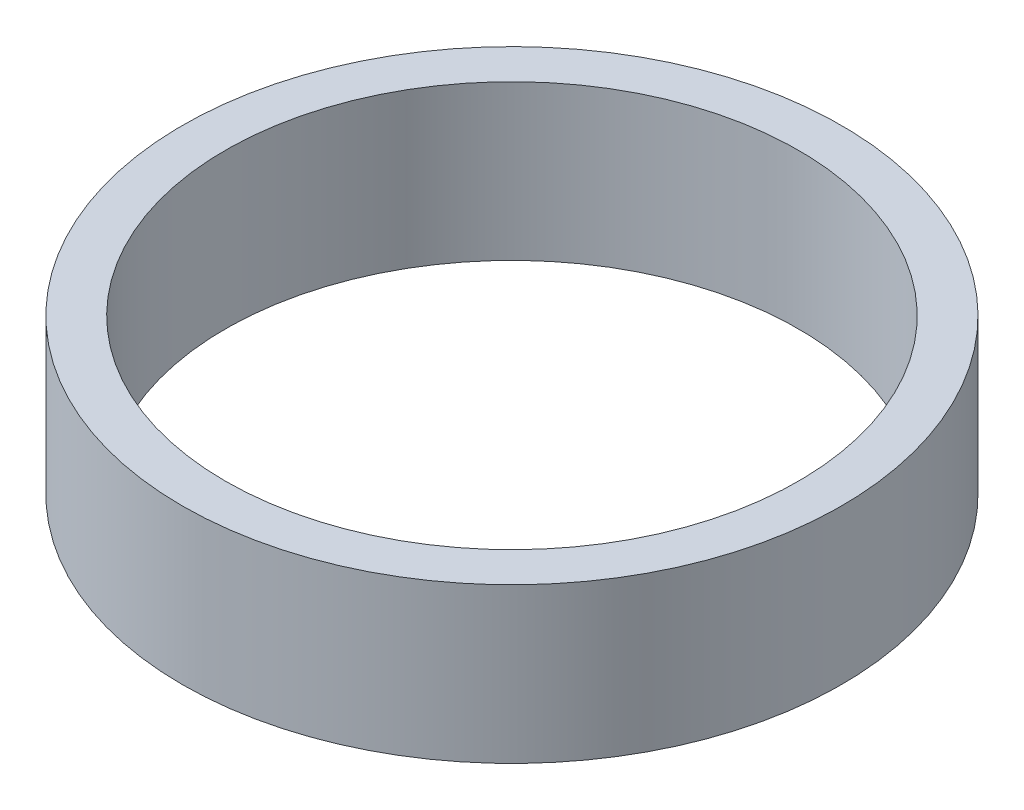
ISO-10303-21;
HEADER;
FILE_DESCRIPTION(('STEP AP214'),'2;1');
FILE_NAME('part.step','',(''),(''),'','','');
FILE_SCHEMA(('AUTOMOTIVE_DESIGN { 1 0 10303 214 1 1 1 1 }'));
ENDSEC;
DATA;
#1=APPLICATION_CONTEXT('core data for automotive mechanical design processes');
#2=APPLICATION_PROTOCOL_DEFINITION('international standard','automotive_design',2000,#1);
#3=PRODUCT_CONTEXT('',#1,'mechanical');
#4=PRODUCT('Part','Part','',(#3));
#5=PRODUCT_RELATED_PRODUCT_CATEGORY('part','',(#4));
#6=PRODUCT_DEFINITION_FORMATION('','',#4);
#7=PRODUCT_DEFINITION_CONTEXT('part definition',#1,'design');
#8=PRODUCT_DEFINITION('design','',#6,#7);
#9=PRODUCT_DEFINITION_SHAPE('','',#8);
#10=(LENGTH_UNIT() NAMED_UNIT(*) SI_UNIT(.MILLI.,.METRE.));
#11=(NAMED_UNIT(*) PLANE_ANGLE_UNIT() SI_UNIT($,.RADIAN.));
#12=(NAMED_UNIT(*) SI_UNIT($,.STERADIAN.) SOLID_ANGLE_UNIT());
#13=UNCERTAINTY_MEASURE_WITH_UNIT(LENGTH_MEASURE(1.E-05),#10,'distance_accuracy_value','');
#14=(GEOMETRIC_REPRESENTATION_CONTEXT(3) GLOBAL_UNCERTAINTY_ASSIGNED_CONTEXT((#13)) GLOBAL_UNIT_ASSIGNED_CONTEXT((#10,
#11,#12)) REPRESENTATION_CONTEXT('',''));
#15=CARTESIAN_POINT('',(0.,0.,0.));
#16=DIRECTION('',(0.,0.,1.));
#17=DIRECTION('',(1.,0.,0.));
#18=AXIS2_PLACEMENT_3D('',#15,#16,#17);
#19=CARTESIAN_POINT('',(0.,27.,0.));
#20=DIRECTION('',(0.,-1.,0.));
#21=DIRECTION('',(0.,0.,-1.));
#22=AXIS2_PLACEMENT_3D('',#19,#20,#21);
#23=CYLINDRICAL_SURFACE('',#22,57.5);
#24=CARTESIAN_POINT('',(0.,27.,0.));
#25=DIRECTION('',(0.,1.,0.));
#26=DIRECTION('',(0.,0.,1.));
#27=AXIS2_PLACEMENT_3D('',#24,#25,#26);
#28=CIRCLE('',#27,57.5);
#29=CARTESIAN_POINT('',(0.,27.,57.5));
#30=VERTEX_POINT('',#29);
#31=EDGE_CURVE('E10',#30,#30,#28,.T.);
#32=ORIENTED_EDGE('',*,*,#31,.F.);
#33=EDGE_LOOP('',(#32));
#34=FACE_BOUND('',#33,.T.);
#35=CARTESIAN_POINT('',(0.,0.,0.));
#36=DIRECTION('',(0.,1.,0.));
#37=DIRECTION('',(0.,0.,1.));
#38=AXIS2_PLACEMENT_3D('',#35,#36,#37);
#39=CIRCLE('',#38,57.5);
#40=CARTESIAN_POINT('',(0.,0.,57.5));
#41=VERTEX_POINT('',#40);
#42=EDGE_CURVE('E37',#41,#41,#39,.T.);
#43=ORIENTED_EDGE('',*,*,#42,.T.);
#44=EDGE_LOOP('',(#43));
#45=FACE_BOUND('',#44,.T.);
#46=ADVANCED_FACE('F40',(#34,#45),#23,.T.);
#47=CARTESIAN_POINT('',(0.,27.,0.));
#48=DIRECTION('',(0.,1.,0.));
#49=DIRECTION('',(0.,0.,1.));
#50=AXIS2_PLACEMENT_3D('',#47,#48,#49);
#51=PLANE('',#50);
#52=CARTESIAN_POINT('',(0.,27.,0.));
#53=DIRECTION('',(0.,1.,0.));
#54=DIRECTION('',(0.,0.,1.));
#55=AXIS2_PLACEMENT_3D('',#52,#53,#54);
#56=CIRCLE('',#55,50.);
#57=CARTESIAN_POINT('',(0.,27.,50.));
#58=VERTEX_POINT('',#57);
#59=EDGE_CURVE('E50',#58,#58,#56,.T.);
#60=ORIENTED_EDGE('',*,*,#59,.F.);
#61=EDGE_LOOP('',(#60));
#62=FACE_BOUND('',#61,.T.);
#63=ORIENTED_EDGE('',*,*,#31,.T.);
#64=EDGE_LOOP('',(#63));
#65=FACE_BOUND('',#64,.T.);
#66=ADVANCED_FACE('F59',(#62,#65),#51,.T.);
#67=CARTESIAN_POINT('',(0.,0.,0.));
#68=DIRECTION('',(0.,1.,0.));
#69=DIRECTION('',(0.,0.,1.));
#70=AXIS2_PLACEMENT_3D('',#67,#68,#69);
#71=PLANE('',#70);
#72=CARTESIAN_POINT('',(0.,0.,0.));
#73=DIRECTION('',(0.,1.,0.));
#74=DIRECTION('',(0.,0.,1.));
#75=AXIS2_PLACEMENT_3D('',#72,#73,#74);
#76=CIRCLE('',#75,50.);
#77=CARTESIAN_POINT('',(0.,0.,50.));
#78=VERTEX_POINT('',#77);
#79=EDGE_CURVE('E47',#78,#78,#76,.T.);
#80=ORIENTED_EDGE('',*,*,#79,.T.);
#81=EDGE_LOOP('',(#80));
#82=FACE_BOUND('',#81,.T.);
#83=ORIENTED_EDGE('',*,*,#42,.F.);
#84=EDGE_LOOP('',(#83));
#85=FACE_BOUND('',#84,.T.);
#86=ADVANCED_FACE('F58',(#82,#85),#71,.F.);
#87=CARTESIAN_POINT('',(0.,27.,0.));
#88=DIRECTION('',(0.,-1.,0.));
#89=DIRECTION('',(0.,0.,-1.));
#90=AXIS2_PLACEMENT_3D('',#87,#88,#89);
#91=CYLINDRICAL_SURFACE('',#90,50.);
#92=ORIENTED_EDGE('',*,*,#59,.T.);
#93=EDGE_LOOP('',(#92));
#94=FACE_BOUND('',#93,.T.);
#95=ORIENTED_EDGE('',*,*,#79,.F.);
#96=EDGE_LOOP('',(#95));
#97=FACE_BOUND('',#96,.T.);
#98=ADVANCED_FACE('F54',(#94,#97),#91,.F.);
#99=CLOSED_SHELL('',(#46,#66,#86,#98));
#100=MANIFOLD_SOLID_BREP('B2',#99);
#101=ADVANCED_BREP_SHAPE_REPRESENTATION('',(#18,#100),#14);
#102=SHAPE_DEFINITION_REPRESENTATION(#9,#101);
ENDSEC;
END-ISO-10303-21;
